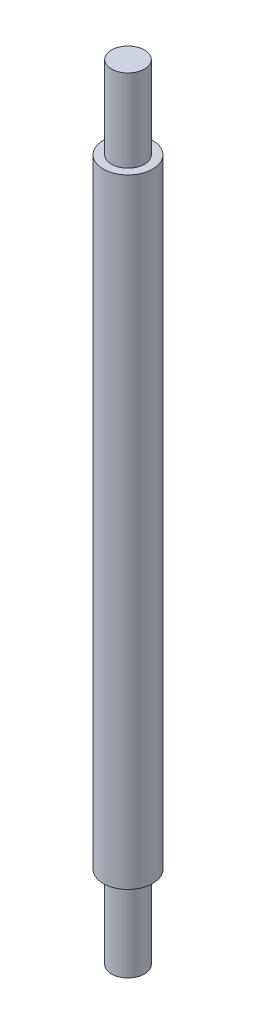
ISO-10303-21;
HEADER;
FILE_DESCRIPTION(('STEP AP214'),'2;1');
FILE_NAME('part.step','',(''),(''),'','','');
FILE_SCHEMA(('AUTOMOTIVE_DESIGN { 1 0 10303 214 1 1 1 1 }'));
ENDSEC;
DATA;
#1=APPLICATION_CONTEXT('core data for automotive mechanical design processes');
#2=APPLICATION_PROTOCOL_DEFINITION('international standard','automotive_design',2000,#1);
#3=PRODUCT_CONTEXT('',#1,'mechanical');
#4=PRODUCT('Part','Part','',(#3));
#5=PRODUCT_RELATED_PRODUCT_CATEGORY('part','',(#4));
#6=PRODUCT_DEFINITION_FORMATION('','',#4);
#7=PRODUCT_DEFINITION_CONTEXT('part definition',#1,'design');
#8=PRODUCT_DEFINITION('design','',#6,#7);
#9=PRODUCT_DEFINITION_SHAPE('','',#8);
#10=(LENGTH_UNIT() NAMED_UNIT(*) SI_UNIT(.MILLI.,.METRE.));
#11=(NAMED_UNIT(*) PLANE_ANGLE_UNIT() SI_UNIT($,.RADIAN.));
#12=(NAMED_UNIT(*) SI_UNIT($,.STERADIAN.) SOLID_ANGLE_UNIT());
#13=UNCERTAINTY_MEASURE_WITH_UNIT(LENGTH_MEASURE(1.E-05),#10,'distance_accuracy_value','');
#14=(GEOMETRIC_REPRESENTATION_CONTEXT(3) GLOBAL_UNCERTAINTY_ASSIGNED_CONTEXT((#13)) GLOBAL_UNIT_ASSIGNED_CONTEXT((#10,
#11,#12)) REPRESENTATION_CONTEXT('',''));
#15=CARTESIAN_POINT('',(0.,0.,0.));
#16=DIRECTION('',(0.,0.,1.));
#17=DIRECTION('',(1.,0.,0.));
#18=AXIS2_PLACEMENT_3D('',#15,#16,#17);
#19=CARTESIAN_POINT('',(0.,75.,0.));
#20=DIRECTION('',(0.,-1.,0.));
#21=DIRECTION('',(0.,0.,-1.));
#22=AXIS2_PLACEMENT_3D('',#19,#20,#21);
#23=CYLINDRICAL_SURFACE('',#22,3.);
#24=CARTESIAN_POINT('',(0.,75.,0.));
#25=DIRECTION('',(0.,1.,0.));
#26=DIRECTION('',(0.,0.,1.));
#27=AXIS2_PLACEMENT_3D('',#24,#25,#26);
#28=CIRCLE('',#27,3.);
#29=CARTESIAN_POINT('',(0.,75.,3.));
#30=VERTEX_POINT('',#29);
#31=EDGE_CURVE('E55',#30,#30,#28,.T.);
#32=ORIENTED_EDGE('',*,*,#31,.F.);
#33=EDGE_LOOP('',(#32));
#34=FACE_BOUND('',#33,.T.);
#35=CARTESIAN_POINT('',(0.,0.,0.));
#36=DIRECTION('',(0.,1.,0.));
#37=DIRECTION('',(0.,0.,1.));
#38=AXIS2_PLACEMENT_3D('',#35,#36,#37);
#39=CIRCLE('',#38,3.);
#40=CARTESIAN_POINT('',(0.,0.,3.));
#41=VERTEX_POINT('',#40);
#42=EDGE_CURVE('E44',#41,#41,#39,.T.);
#43=ORIENTED_EDGE('',*,*,#42,.T.);
#44=EDGE_LOOP('',(#43));
#45=FACE_BOUND('',#44,.T.);
#46=ADVANCED_FACE('F41',(#34,#45),#23,.T.);
#47=CARTESIAN_POINT('',(0.,75.,0.));
#48=DIRECTION('',(0.,1.,0.));
#49=DIRECTION('',(0.,0.,1.));
#50=AXIS2_PLACEMENT_3D('',#47,#48,#49);
#51=PLANE('',#50);
#52=CARTESIAN_POINT('',(0.,75.,0.));
#53=DIRECTION('',(0.,1.,0.));
#54=DIRECTION('',(0.,0.,1.));
#55=AXIS2_PLACEMENT_3D('',#52,#53,#54);
#56=CIRCLE('',#55,2.);
#57=CARTESIAN_POINT('',(0.,75.,2.));
#58=VERTEX_POINT('',#57);
#59=EDGE_CURVE('E49',#58,#58,#56,.T.);
#60=ORIENTED_EDGE('',*,*,#59,.F.);
#61=EDGE_LOOP('',(#60));
#62=FACE_BOUND('',#61,.T.);
#63=ORIENTED_EDGE('',*,*,#31,.T.);
#64=EDGE_LOOP('',(#63));
#65=FACE_BOUND('',#64,.T.);
#66=ADVANCED_FACE('F75',(#62,#65),#51,.T.);
#67=CARTESIAN_POINT('',(0.,0.,0.));
#68=DIRECTION('',(0.,1.,0.));
#69=DIRECTION('',(0.,0.,1.));
#70=AXIS2_PLACEMENT_3D('',#67,#68,#69);
#71=PLANE('',#70);
#72=CARTESIAN_POINT('',(0.,0.,0.));
#73=DIRECTION('',(0.,-1.,0.));
#74=DIRECTION('',(0.,0.,-1.));
#75=AXIS2_PLACEMENT_3D('',#72,#73,#74);
#76=CIRCLE('',#75,2.);
#77=CARTESIAN_POINT('',(0.,0.,-2.));
#78=VERTEX_POINT('',#77);
#79=EDGE_CURVE('E10',#78,#78,#76,.T.);
#80=ORIENTED_EDGE('',*,*,#79,.F.);
#81=EDGE_LOOP('',(#80));
#82=FACE_BOUND('',#81,.T.);
#83=ORIENTED_EDGE('',*,*,#42,.F.);
#84=EDGE_LOOP('',(#83));
#85=FACE_BOUND('',#84,.T.);
#86=ADVANCED_FACE('F72',(#82,#85),#71,.F.);
#87=CARTESIAN_POINT('',(0.,85.,0.));
#88=DIRECTION('',(0.,-1.,0.));
#89=DIRECTION('',(0.,0.,-1.));
#90=AXIS2_PLACEMENT_3D('',#87,#88,#89);
#91=CYLINDRICAL_SURFACE('',#90,2.);
#92=CARTESIAN_POINT('',(0.,85.,0.));
#93=DIRECTION('',(0.,1.,0.));
#94=DIRECTION('',(0.,0.,1.));
#95=AXIS2_PLACEMENT_3D('',#92,#93,#94);
#96=CIRCLE('',#95,2.);
#97=CARTESIAN_POINT('',(0.,85.,2.));
#98=VERTEX_POINT('',#97);
#99=EDGE_CURVE('E60',#98,#98,#96,.T.);
#100=ORIENTED_EDGE('',*,*,#99,.F.);
#101=EDGE_LOOP('',(#100));
#102=FACE_BOUND('',#101,.T.);
#103=ORIENTED_EDGE('',*,*,#59,.T.);
#104=EDGE_LOOP('',(#103));
#105=FACE_BOUND('',#104,.T.);
#106=ADVANCED_FACE('F74',(#102,#105),#91,.T.);
#107=CARTESIAN_POINT('',(0.,85.,0.));
#108=DIRECTION('',(0.,1.,0.));
#109=DIRECTION('',(0.,0.,1.));
#110=AXIS2_PLACEMENT_3D('',#107,#108,#109);
#111=PLANE('',#110);
#112=ORIENTED_EDGE('',*,*,#99,.T.);
#113=EDGE_LOOP('',(#112));
#114=FACE_BOUND('',#113,.T.);
#115=ADVANCED_FACE('F81',(#114),#111,.T.);
#116=CARTESIAN_POINT('',(0.,-10.,0.));
#117=DIRECTION('',(0.,1.,0.));
#118=DIRECTION('',(0.,0.,1.));
#119=AXIS2_PLACEMENT_3D('',#116,#117,#118);
#120=CYLINDRICAL_SURFACE('',#119,2.);
#121=CARTESIAN_POINT('',(0.,-10.,0.));
#122=DIRECTION('',(0.,-1.,0.));
#123=DIRECTION('',(0.,0.,-1.));
#124=AXIS2_PLACEMENT_3D('',#121,#122,#123);
#125=CIRCLE('',#124,2.);
#126=CARTESIAN_POINT('',(0.,-10.,-2.));
#127=VERTEX_POINT('',#126);
#128=EDGE_CURVE('E59',#127,#127,#125,.T.);
#129=ORIENTED_EDGE('',*,*,#128,.F.);
#130=EDGE_LOOP('',(#129));
#131=FACE_BOUND('',#130,.T.);
#132=ORIENTED_EDGE('',*,*,#79,.T.);
#133=EDGE_LOOP('',(#132));
#134=FACE_BOUND('',#133,.T.);
#135=ADVANCED_FACE('F111',(#131,#134),#120,.T.);
#136=CARTESIAN_POINT('',(0.,-10.,0.));
#137=DIRECTION('',(0.,-1.,0.));
#138=DIRECTION('',(0.,0.,-1.));
#139=AXIS2_PLACEMENT_3D('',#136,#137,#138);
#140=PLANE('',#139);
#141=ORIENTED_EDGE('',*,*,#128,.T.);
#142=EDGE_LOOP('',(#141));
#143=FACE_BOUND('',#142,.T.);
#144=ADVANCED_FACE('F127',(#143),#140,.T.);
#145=CLOSED_SHELL('',(#46,#66,#86,#106,#115,#135,#144));
#146=MANIFOLD_SOLID_BREP('B2',#145);
#147=ADVANCED_BREP_SHAPE_REPRESENTATION('',(#18,#146),#14);
#148=SHAPE_DEFINITION_REPRESENTATION(#9,#147);
ENDSEC;
END-ISO-10303-21;
